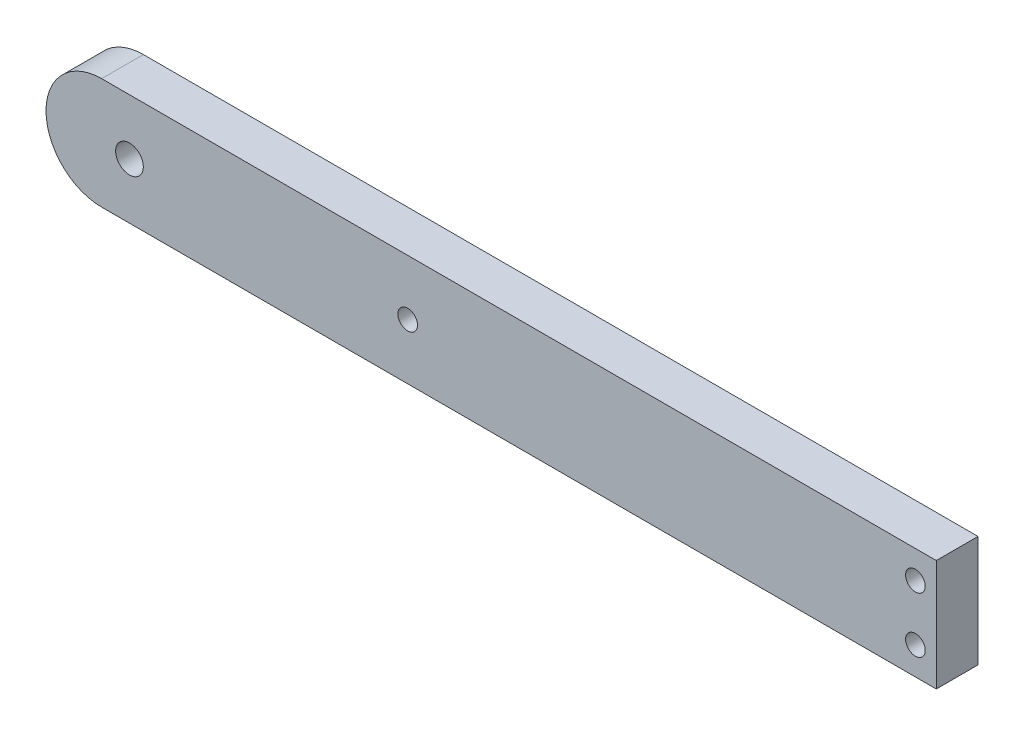
ISO-10303-21;
HEADER;
FILE_DESCRIPTION(('STEP AP214'),'2;1');
FILE_NAME('part.step','',(''),(''),'','','');
FILE_SCHEMA(('AUTOMOTIVE_DESIGN { 1 0 10303 214 1 1 1 1 }'));
ENDSEC;
DATA;
#1=APPLICATION_CONTEXT('core data for automotive mechanical design processes');
#2=APPLICATION_PROTOCOL_DEFINITION('international standard','automotive_design',2000,#1);
#3=PRODUCT_CONTEXT('',#1,'mechanical');
#4=PRODUCT('Part','Part','',(#3));
#5=PRODUCT_RELATED_PRODUCT_CATEGORY('part','',(#4));
#6=PRODUCT_DEFINITION_FORMATION('','',#4);
#7=PRODUCT_DEFINITION_CONTEXT('part definition',#1,'design');
#8=PRODUCT_DEFINITION('design','',#6,#7);
#9=PRODUCT_DEFINITION_SHAPE('','',#8);
#10=(LENGTH_UNIT() NAMED_UNIT(*) SI_UNIT(.MILLI.,.METRE.));
#11=(NAMED_UNIT(*) PLANE_ANGLE_UNIT() SI_UNIT($,.RADIAN.));
#12=(NAMED_UNIT(*) SI_UNIT($,.STERADIAN.) SOLID_ANGLE_UNIT());
#13=UNCERTAINTY_MEASURE_WITH_UNIT(LENGTH_MEASURE(1.E-05),#10,'distance_accuracy_value','');
#14=(GEOMETRIC_REPRESENTATION_CONTEXT(3) GLOBAL_UNCERTAINTY_ASSIGNED_CONTEXT((#13)) GLOBAL_UNIT_ASSIGNED_CONTEXT((#10,
#11,#12)) REPRESENTATION_CONTEXT('',''));
#15=CARTESIAN_POINT('',(0.,0.,0.));
#16=DIRECTION('',(0.,0.,1.));
#17=DIRECTION('',(1.,0.,0.));
#18=AXIS2_PLACEMENT_3D('',#15,#16,#17);
#19=CARTESIAN_POINT('',(0.,0.,9.525));
#20=DIRECTION('',(0.,0.,1.));
#21=DIRECTION('',(1.,0.,0.));
#22=AXIS2_PLACEMENT_3D('',#19,#20,#21);
#23=PLANE('',#22);
#24=CARTESIAN_POINT('',(-120.65,12.7,9.525));
#25=DIRECTION('',(0.,0.,1.));
#26=DIRECTION('',(1.,0.,0.));
#27=AXIS2_PLACEMENT_3D('',#24,#25,#26);
#28=CIRCLE('',#27,2.2479);
#29=CARTESIAN_POINT('',(-118.4021,12.7,9.525));
#30=VERTEX_POINT('',#29);
#31=EDGE_CURVE('E119',#30,#30,#28,.T.);
#32=ORIENTED_EDGE('',*,*,#31,.F.);
#33=EDGE_LOOP('',(#32));
#34=FACE_BOUND('',#33,.T.);
#35=CARTESIAN_POINT('',(-184.15,12.7,9.525));
#36=DIRECTION('',(0.,0.,1.));
#37=DIRECTION('',(1.,0.,0.));
#38=AXIS2_PLACEMENT_3D('',#35,#36,#37);
#39=CIRCLE('',#38,3.1623);
#40=CARTESIAN_POINT('',(-180.9877,12.7,9.525));
#41=VERTEX_POINT('',#40);
#42=EDGE_CURVE('E111',#41,#41,#39,.T.);
#43=ORIENTED_EDGE('',*,*,#42,.F.);
#44=EDGE_LOOP('',(#43));
#45=FACE_BOUND('',#44,.T.);
#46=CARTESIAN_POINT('',(-4.7625,6.34999999999999,9.525));
#47=DIRECTION('',(0.,0.,1.));
#48=DIRECTION('',(1.,0.,0.));
#49=AXIS2_PLACEMENT_3D('',#46,#47,#48);
#50=CIRCLE('',#49,2.24789999999999);
#51=CARTESIAN_POINT('',(-2.51460000000001,6.34999999999999,9.525));
#52=VERTEX_POINT('',#51);
#53=EDGE_CURVE('E107',#52,#52,#50,.T.);
#54=ORIENTED_EDGE('',*,*,#53,.F.);
#55=EDGE_LOOP('',(#54));
#56=FACE_BOUND('',#55,.T.);
#57=CARTESIAN_POINT('',(-4.7625,19.05,9.525));
#58=DIRECTION('',(0.,0.,1.));
#59=DIRECTION('',(1.,0.,0.));
#60=AXIS2_PLACEMENT_3D('',#57,#58,#59);
#61=CIRCLE('',#60,2.24789999999999);
#62=CARTESIAN_POINT('',(-2.51460000000001,19.05,9.525));
#63=VERTEX_POINT('',#62);
#64=EDGE_CURVE('E97',#63,#63,#61,.T.);
#65=ORIENTED_EDGE('',*,*,#64,.F.);
#66=EDGE_LOOP('',(#65));
#67=FACE_BOUND('',#66,.T.);
#68=CARTESIAN_POINT('',(-190.5,12.7,9.525));
#69=DIRECTION('',(0.,0.,1.));
#70=DIRECTION('',(1.,0.,0.));
#71=AXIS2_PLACEMENT_3D('',#68,#69,#70);
#72=CIRCLE('',#71,12.7);
#73=CARTESIAN_POINT('',(-190.5,0.,9.525));
#74=VERTEX_POINT('',#73);
#75=CARTESIAN_POINT('',(-190.5,25.4,9.525));
#76=VERTEX_POINT('',#75);
#77=EDGE_CURVE('E124',#74,#76,#72,.F.);
#78=ORIENTED_EDGE('',*,*,#77,.F.);
#79=DIRECTION('',(1.,0.,0.));
#80=VECTOR('',#79,1.);
#81=CARTESIAN_POINT('',(0.,0.,9.525));
#82=LINE('',#81,#80);
#83=CARTESIAN_POINT('',(0.,0.,9.525));
#84=VERTEX_POINT('',#83);
#85=EDGE_CURVE('E60',#74,#84,#82,.T.);
#86=ORIENTED_EDGE('',*,*,#85,.T.);
#87=DIRECTION('',(0.,1.,0.));
#88=VECTOR('',#87,1.);
#89=CARTESIAN_POINT('',(0.,0.,9.525));
#90=LINE('',#89,#88);
#91=CARTESIAN_POINT('',(0.,25.4,9.525));
#92=VERTEX_POINT('',#91);
#93=EDGE_CURVE('E83',#84,#92,#90,.T.);
#94=ORIENTED_EDGE('',*,*,#93,.T.);
#95=DIRECTION('',(-1.,0.,0.));
#96=VECTOR('',#95,1.);
#97=CARTESIAN_POINT('',(0.,25.4,9.525));
#98=LINE('',#97,#96);
#99=EDGE_CURVE('E101',#92,#76,#98,.T.);
#100=ORIENTED_EDGE('',*,*,#99,.T.);
#101=EDGE_LOOP('',(#78,#86,#94,#100));
#102=FACE_BOUND('',#101,.T.);
#103=ADVANCED_FACE('F35',(#34,#45,#56,#67,#102),#23,.T.);
#104=CARTESIAN_POINT('',(0.,0.,0.));
#105=DIRECTION('',(0.,0.,1.));
#106=DIRECTION('',(1.,0.,0.));
#107=AXIS2_PLACEMENT_3D('',#104,#105,#106);
#108=PLANE('',#107);
#109=CARTESIAN_POINT('',(-120.65,12.7,0.));
#110=DIRECTION('',(0.,0.,1.));
#111=DIRECTION('',(1.,0.,0.));
#112=AXIS2_PLACEMENT_3D('',#109,#110,#111);
#113=CIRCLE('',#112,2.2479);
#114=CARTESIAN_POINT('',(-118.4021,12.7,0.));
#115=VERTEX_POINT('',#114);
#116=EDGE_CURVE('E114',#115,#115,#113,.T.);
#117=ORIENTED_EDGE('',*,*,#116,.T.);
#118=EDGE_LOOP('',(#117));
#119=FACE_BOUND('',#118,.T.);
#120=CARTESIAN_POINT('',(-184.15,12.7,0.));
#121=DIRECTION('',(0.,0.,1.));
#122=DIRECTION('',(1.,0.,0.));
#123=AXIS2_PLACEMENT_3D('',#120,#121,#122);
#124=CIRCLE('',#123,3.1623);
#125=CARTESIAN_POINT('',(-180.9877,12.7,0.));
#126=VERTEX_POINT('',#125);
#127=EDGE_CURVE('E110',#126,#126,#124,.T.);
#128=ORIENTED_EDGE('',*,*,#127,.T.);
#129=EDGE_LOOP('',(#128));
#130=FACE_BOUND('',#129,.T.);
#131=CARTESIAN_POINT('',(-4.7625,6.34999999999999,0.));
#132=DIRECTION('',(0.,0.,1.));
#133=DIRECTION('',(1.,0.,0.));
#134=AXIS2_PLACEMENT_3D('',#131,#132,#133);
#135=CIRCLE('',#134,2.24789999999999);
#136=CARTESIAN_POINT('',(-2.51460000000001,6.34999999999999,0.));
#137=VERTEX_POINT('',#136);
#138=EDGE_CURVE('E39',#137,#137,#135,.T.);
#139=ORIENTED_EDGE('',*,*,#138,.T.);
#140=EDGE_LOOP('',(#139));
#141=FACE_BOUND('',#140,.T.);
#142=CARTESIAN_POINT('',(-4.7625,19.05,0.));
#143=DIRECTION('',(0.,0.,1.));
#144=DIRECTION('',(1.,0.,0.));
#145=AXIS2_PLACEMENT_3D('',#142,#143,#144);
#146=CIRCLE('',#145,2.24789999999999);
#147=CARTESIAN_POINT('',(-2.51460000000001,19.05,0.));
#148=VERTEX_POINT('',#147);
#149=EDGE_CURVE('E93',#148,#148,#146,.T.);
#150=ORIENTED_EDGE('',*,*,#149,.T.);
#151=EDGE_LOOP('',(#150));
#152=FACE_BOUND('',#151,.T.);
#153=DIRECTION('',(1.,0.,0.));
#154=VECTOR('',#153,1.);
#155=CARTESIAN_POINT('',(0.,0.,0.));
#156=LINE('',#155,#154);
#157=CARTESIAN_POINT('',(-190.5,0.,0.));
#158=VERTEX_POINT('',#157);
#159=CARTESIAN_POINT('',(0.,0.,0.));
#160=VERTEX_POINT('',#159);
#161=EDGE_CURVE('E74',#158,#160,#156,.T.);
#162=ORIENTED_EDGE('',*,*,#161,.F.);
#163=CARTESIAN_POINT('',(-190.5,12.7,0.));
#164=DIRECTION('',(0.,0.,1.));
#165=DIRECTION('',(1.,0.,0.));
#166=AXIS2_PLACEMENT_3D('',#163,#164,#165);
#167=CIRCLE('',#166,12.7);
#168=CARTESIAN_POINT('',(-190.5,25.4,0.));
#169=VERTEX_POINT('',#168);
#170=EDGE_CURVE('E123',#158,#169,#167,.F.);
#171=ORIENTED_EDGE('',*,*,#170,.T.);
#172=DIRECTION('',(-1.,0.,0.));
#173=VECTOR('',#172,1.);
#174=CARTESIAN_POINT('',(0.,25.4,0.));
#175=LINE('',#174,#173);
#176=CARTESIAN_POINT('',(0.,25.4,0.));
#177=VERTEX_POINT('',#176);
#178=EDGE_CURVE('E84',#177,#169,#175,.T.);
#179=ORIENTED_EDGE('',*,*,#178,.F.);
#180=DIRECTION('',(0.,1.,0.));
#181=VECTOR('',#180,1.);
#182=CARTESIAN_POINT('',(0.,0.,0.));
#183=LINE('',#182,#181);
#184=EDGE_CURVE('E89',#160,#177,#183,.T.);
#185=ORIENTED_EDGE('',*,*,#184,.F.);
#186=EDGE_LOOP('',(#162,#171,#179,#185));
#187=FACE_BOUND('',#186,.T.);
#188=ADVANCED_FACE('F91',(#119,#130,#141,#152,#187),#108,.F.);
#189=CARTESIAN_POINT('',(0.,25.4,9.525));
#190=DIRECTION('',(0.,-1.,0.));
#191=DIRECTION('',(1.,0.,0.));
#192=AXIS2_PLACEMENT_3D('',#189,#190,#191);
#193=PLANE('',#192);
#194=DIRECTION('',(0.,0.,1.));
#195=VECTOR('',#194,1.);
#196=CARTESIAN_POINT('',(-190.5,25.4,0.));
#197=LINE('',#196,#195);
#198=EDGE_CURVE('E51',#169,#76,#197,.T.);
#199=ORIENTED_EDGE('',*,*,#198,.T.);
#200=ORIENTED_EDGE('',*,*,#99,.F.);
#201=DIRECTION('',(0.,0.,-1.));
#202=VECTOR('',#201,1.);
#203=CARTESIAN_POINT('',(0.,25.4,9.525));
#204=LINE('',#203,#202);
#205=EDGE_CURVE('E11',#92,#177,#204,.T.);
#206=ORIENTED_EDGE('',*,*,#205,.T.);
#207=ORIENTED_EDGE('',*,*,#178,.T.);
#208=EDGE_LOOP('',(#199,#200,#206,#207));
#209=FACE_BOUND('',#208,.T.);
#210=ADVANCED_FACE('F132',(#209),#193,.F.);
#211=CARTESIAN_POINT('',(0.,0.,9.525));
#212=DIRECTION('',(-1.,0.,0.));
#213=DIRECTION('',(0.,0.,1.));
#214=AXIS2_PLACEMENT_3D('',#211,#212,#213);
#215=PLANE('',#214);
#216=ORIENTED_EDGE('',*,*,#184,.T.);
#217=ORIENTED_EDGE('',*,*,#205,.F.);
#218=ORIENTED_EDGE('',*,*,#93,.F.);
#219=DIRECTION('',(0.,0.,-1.));
#220=VECTOR('',#219,1.);
#221=CARTESIAN_POINT('',(0.,0.,9.525));
#222=LINE('',#221,#220);
#223=EDGE_CURVE('E44',#84,#160,#222,.T.);
#224=ORIENTED_EDGE('',*,*,#223,.T.);
#225=EDGE_LOOP('',(#216,#217,#218,#224));
#226=FACE_BOUND('',#225,.T.);
#227=ADVANCED_FACE('F37',(#226),#215,.F.);
#228=CARTESIAN_POINT('',(0.,0.,9.525));
#229=DIRECTION('',(0.,1.,0.));
#230=DIRECTION('',(-1.,0.,0.));
#231=AXIS2_PLACEMENT_3D('',#228,#229,#230);
#232=PLANE('',#231);
#233=ORIENTED_EDGE('',*,*,#85,.F.);
#234=DIRECTION('',(0.,0.,1.));
#235=VECTOR('',#234,1.);
#236=CARTESIAN_POINT('',(-190.5,0.,0.));
#237=LINE('',#236,#235);
#238=EDGE_CURVE('E80',#158,#74,#237,.T.);
#239=ORIENTED_EDGE('',*,*,#238,.F.);
#240=ORIENTED_EDGE('',*,*,#161,.T.);
#241=ORIENTED_EDGE('',*,*,#223,.F.);
#242=EDGE_LOOP('',(#233,#239,#240,#241));
#243=FACE_BOUND('',#242,.T.);
#244=ADVANCED_FACE('F76',(#243),#232,.F.);
#245=CARTESIAN_POINT('',(-4.7625,19.05,9.525));
#246=DIRECTION('',(0.,0.,1.));
#247=DIRECTION('',(1.,0.,0.));
#248=AXIS2_PLACEMENT_3D('',#245,#246,#247);
#249=CYLINDRICAL_SURFACE('',#248,2.24789999999999);
#250=ORIENTED_EDGE('',*,*,#64,.T.);
#251=EDGE_LOOP('',(#250));
#252=FACE_BOUND('',#251,.T.);
#253=ORIENTED_EDGE('',*,*,#149,.F.);
#254=EDGE_LOOP('',(#253));
#255=FACE_BOUND('',#254,.T.);
#256=ADVANCED_FACE('F149',(#252,#255),#249,.F.);
#257=CARTESIAN_POINT('',(-4.7625,6.34999999999999,9.525));
#258=DIRECTION('',(0.,0.,1.));
#259=DIRECTION('',(1.,0.,0.));
#260=AXIS2_PLACEMENT_3D('',#257,#258,#259);
#261=CYLINDRICAL_SURFACE('',#260,2.24789999999999);
#262=ORIENTED_EDGE('',*,*,#53,.T.);
#263=EDGE_LOOP('',(#262));
#264=FACE_BOUND('',#263,.T.);
#265=ORIENTED_EDGE('',*,*,#138,.F.);
#266=EDGE_LOOP('',(#265));
#267=FACE_BOUND('',#266,.T.);
#268=ADVANCED_FACE('F155',(#264,#267),#261,.F.);
#269=CARTESIAN_POINT('',(-184.15,12.7,0.));
#270=DIRECTION('',(0.,0.,1.));
#271=DIRECTION('',(1.,0.,0.));
#272=AXIS2_PLACEMENT_3D('',#269,#270,#271);
#273=CYLINDRICAL_SURFACE('',#272,3.1623);
#274=ORIENTED_EDGE('',*,*,#127,.F.);
#275=EDGE_LOOP('',(#274));
#276=FACE_BOUND('',#275,.T.);
#277=ORIENTED_EDGE('',*,*,#42,.T.);
#278=EDGE_LOOP('',(#277));
#279=FACE_BOUND('',#278,.T.);
#280=ADVANCED_FACE('F160',(#276,#279),#273,.F.);
#281=CARTESIAN_POINT('',(-120.65,12.7,9.525));
#282=DIRECTION('',(0.,0.,1.));
#283=DIRECTION('',(1.,0.,0.));
#284=AXIS2_PLACEMENT_3D('',#281,#282,#283);
#285=CYLINDRICAL_SURFACE('',#284,2.2479);
#286=ORIENTED_EDGE('',*,*,#31,.T.);
#287=EDGE_LOOP('',(#286));
#288=FACE_BOUND('',#287,.T.);
#289=ORIENTED_EDGE('',*,*,#116,.F.);
#290=EDGE_LOOP('',(#289));
#291=FACE_BOUND('',#290,.T.);
#292=ADVANCED_FACE('F170',(#288,#291),#285,.F.);
#293=CARTESIAN_POINT('',(-190.5,12.7,0.));
#294=DIRECTION('',(0.,0.,1.));
#295=DIRECTION('',(1.,0.,0.));
#296=AXIS2_PLACEMENT_3D('',#293,#294,#295);
#297=CYLINDRICAL_SURFACE('',#296,12.7);
#298=ORIENTED_EDGE('',*,*,#77,.T.);
#299=ORIENTED_EDGE('',*,*,#198,.F.);
#300=ORIENTED_EDGE('',*,*,#170,.F.);
#301=ORIENTED_EDGE('',*,*,#238,.T.);
#302=EDGE_LOOP('',(#298,#299,#300,#301));
#303=FACE_BOUND('',#302,.T.);
#304=ADVANCED_FACE('F128',(#303),#297,.T.);
#305=CLOSED_SHELL('',(#103,#188,#210,#227,#244,#256,#268,#280,#292,#304));
#306=MANIFOLD_SOLID_BREP('B2',#305);
#307=ADVANCED_BREP_SHAPE_REPRESENTATION('',(#18,#306),#14);
#308=SHAPE_DEFINITION_REPRESENTATION(#9,#307);
ENDSEC;
END-ISO-10303-21;
